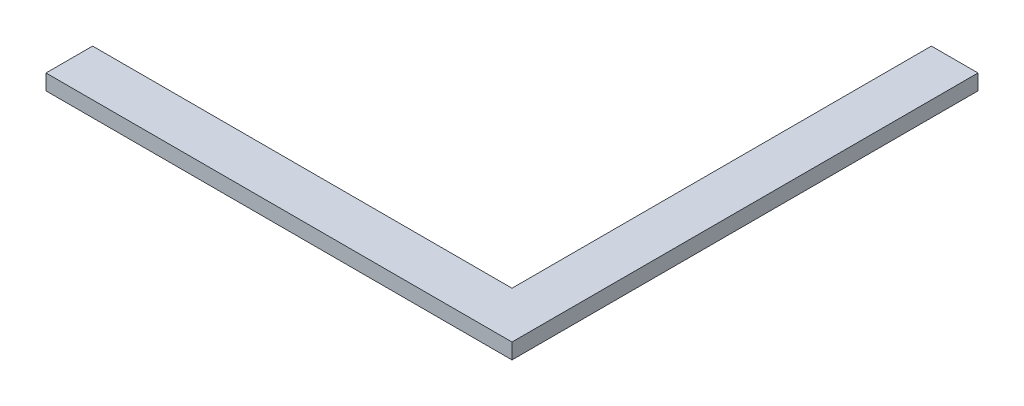
ISO-10303-21;
HEADER;
FILE_DESCRIPTION(('STEP AP214'),'2;1');
FILE_NAME('part.step','',(''),(''),'','','');
FILE_SCHEMA(('AUTOMOTIVE_DESIGN { 1 0 10303 214 1 1 1 1 }'));
ENDSEC;
DATA;
#1=APPLICATION_CONTEXT('core data for automotive mechanical design processes');
#2=APPLICATION_PROTOCOL_DEFINITION('international standard','automotive_design',2000,#1);
#3=PRODUCT_CONTEXT('',#1,'mechanical');
#4=PRODUCT('Part','Part','',(#3));
#5=PRODUCT_RELATED_PRODUCT_CATEGORY('part','',(#4));
#6=PRODUCT_DEFINITION_FORMATION('','',#4);
#7=PRODUCT_DEFINITION_CONTEXT('part definition',#1,'design');
#8=PRODUCT_DEFINITION('design','',#6,#7);
#9=PRODUCT_DEFINITION_SHAPE('','',#8);
#10=(LENGTH_UNIT() NAMED_UNIT(*) SI_UNIT(.MILLI.,.METRE.));
#11=(NAMED_UNIT(*) PLANE_ANGLE_UNIT() SI_UNIT($,.RADIAN.));
#12=(NAMED_UNIT(*) SI_UNIT($,.STERADIAN.) SOLID_ANGLE_UNIT());
#13=UNCERTAINTY_MEASURE_WITH_UNIT(LENGTH_MEASURE(1.E-05),#10,'distance_accuracy_value','');
#14=(GEOMETRIC_REPRESENTATION_CONTEXT(3) GLOBAL_UNCERTAINTY_ASSIGNED_CONTEXT((#13)) GLOBAL_UNIT_ASSIGNED_CONTEXT((#10,
#11,#12)) REPRESENTATION_CONTEXT('',''));
#15=CARTESIAN_POINT('',(0.,0.,0.));
#16=DIRECTION('',(0.,0.,1.));
#17=DIRECTION('',(1.,0.,0.));
#18=AXIS2_PLACEMENT_3D('',#15,#16,#17);
#19=CARTESIAN_POINT('',(150.,10.,150.));
#20=DIRECTION('',(-1.,0.,0.));
#21=DIRECTION('',(0.,0.,1.));
#22=AXIS2_PLACEMENT_3D('',#19,#20,#21);
#23=PLANE('',#22);
#24=DIRECTION('',(0.,0.,-1.));
#25=VECTOR('',#24,1.);
#26=CARTESIAN_POINT('',(150.,0.,150.));
#27=LINE('',#26,#25);
#28=CARTESIAN_POINT('',(150.,0.,150.));
#29=VERTEX_POINT('',#28);
#30=CARTESIAN_POINT('',(150.,0.,-150.));
#31=VERTEX_POINT('',#30);
#32=EDGE_CURVE('E118',#29,#31,#27,.T.);
#33=ORIENTED_EDGE('',*,*,#32,.T.);
#34=DIRECTION('',(0.,-1.,0.));
#35=VECTOR('',#34,1.);
#36=CARTESIAN_POINT('',(150.,10.,-150.));
#37=LINE('',#36,#35);
#38=CARTESIAN_POINT('',(150.,10.,-150.));
#39=VERTEX_POINT('',#38);
#40=EDGE_CURVE('E11',#39,#31,#37,.T.);
#41=ORIENTED_EDGE('',*,*,#40,.F.);
#42=DIRECTION('',(0.,0.,-1.));
#43=VECTOR('',#42,1.);
#44=CARTESIAN_POINT('',(150.,10.,150.));
#45=LINE('',#44,#43);
#46=CARTESIAN_POINT('',(150.,10.,150.));
#47=VERTEX_POINT('',#46);
#48=EDGE_CURVE('E128',#47,#39,#45,.T.);
#49=ORIENTED_EDGE('',*,*,#48,.F.);
#50=DIRECTION('',(0.,-1.,0.));
#51=VECTOR('',#50,1.);
#52=CARTESIAN_POINT('',(150.,10.,150.));
#53=LINE('',#52,#51);
#54=EDGE_CURVE('E114',#47,#29,#53,.T.);
#55=ORIENTED_EDGE('',*,*,#54,.T.);
#56=EDGE_LOOP('',(#33,#41,#49,#55));
#57=FACE_BOUND('',#56,.T.);
#58=ADVANCED_FACE('F34',(#57),#23,.F.);
#59=CARTESIAN_POINT('',(150.,10.,-150.));
#60=DIRECTION('',(0.,0.,1.));
#61=DIRECTION('',(1.,0.,0.));
#62=AXIS2_PLACEMENT_3D('',#59,#60,#61);
#63=PLANE('',#62);
#64=DIRECTION('',(-1.,0.,0.));
#65=VECTOR('',#64,1.);
#66=CARTESIAN_POINT('',(150.,0.,-150.));
#67=LINE('',#66,#65);
#68=CARTESIAN_POINT('',(120.,0.,-150.));
#69=VERTEX_POINT('',#68);
#70=EDGE_CURVE('E121',#31,#69,#67,.T.);
#71=ORIENTED_EDGE('',*,*,#70,.T.);
#72=DIRECTION('',(0.,-1.,0.));
#73=VECTOR('',#72,1.);
#74=CARTESIAN_POINT('',(120.,10.,-150.));
#75=LINE('',#74,#73);
#76=CARTESIAN_POINT('',(120.,10.,-150.));
#77=VERTEX_POINT('',#76);
#78=EDGE_CURVE('E42',#77,#69,#75,.T.);
#79=ORIENTED_EDGE('',*,*,#78,.F.);
#80=DIRECTION('',(-1.,0.,0.));
#81=VECTOR('',#80,1.);
#82=CARTESIAN_POINT('',(150.,10.,-150.));
#83=LINE('',#82,#81);
#84=EDGE_CURVE('E87',#39,#77,#83,.T.);
#85=ORIENTED_EDGE('',*,*,#84,.F.);
#86=ORIENTED_EDGE('',*,*,#40,.T.);
#87=EDGE_LOOP('',(#71,#79,#85,#86));
#88=FACE_BOUND('',#87,.T.);
#89=ADVANCED_FACE('F152',(#88),#63,.F.);
#90=CARTESIAN_POINT('',(120.,10.,-150.));
#91=DIRECTION('',(1.,0.,0.));
#92=DIRECTION('',(0.,0.,-1.));
#93=AXIS2_PLACEMENT_3D('',#90,#91,#92);
#94=PLANE('',#93);
#95=DIRECTION('',(0.,0.,1.));
#96=VECTOR('',#95,1.);
#97=CARTESIAN_POINT('',(120.,0.,-150.));
#98=LINE('',#97,#96);
#99=CARTESIAN_POINT('',(120.,0.,120.));
#100=VERTEX_POINT('',#99);
#101=EDGE_CURVE('E123',#69,#100,#98,.T.);
#102=ORIENTED_EDGE('',*,*,#101,.T.);
#103=DIRECTION('',(0.,-1.,0.));
#104=VECTOR('',#103,1.);
#105=CARTESIAN_POINT('',(120.,10.,120.));
#106=LINE('',#105,#104);
#107=CARTESIAN_POINT('',(120.,10.,120.));
#108=VERTEX_POINT('',#107);
#109=EDGE_CURVE('E109',#108,#100,#106,.T.);
#110=ORIENTED_EDGE('',*,*,#109,.F.);
#111=DIRECTION('',(0.,0.,1.));
#112=VECTOR('',#111,1.);
#113=CARTESIAN_POINT('',(120.,10.,-150.));
#114=LINE('',#113,#112);
#115=EDGE_CURVE('E100',#77,#108,#114,.T.);
#116=ORIENTED_EDGE('',*,*,#115,.F.);
#117=ORIENTED_EDGE('',*,*,#78,.T.);
#118=EDGE_LOOP('',(#102,#110,#116,#117));
#119=FACE_BOUND('',#118,.T.);
#120=ADVANCED_FACE('F134',(#119),#94,.F.);
#121=CARTESIAN_POINT('',(120.,10.,120.));
#122=DIRECTION('',(0.,0.,1.));
#123=DIRECTION('',(1.,0.,0.));
#124=AXIS2_PLACEMENT_3D('',#121,#122,#123);
#125=PLANE('',#124);
#126=DIRECTION('',(-1.,0.,0.));
#127=VECTOR('',#126,1.);
#128=CARTESIAN_POINT('',(120.,0.,120.));
#129=LINE('',#128,#127);
#130=CARTESIAN_POINT('',(-150.,0.,120.));
#131=VERTEX_POINT('',#130);
#132=EDGE_CURVE('E108',#100,#131,#129,.T.);
#133=ORIENTED_EDGE('',*,*,#132,.T.);
#134=DIRECTION('',(0.,-1.,0.));
#135=VECTOR('',#134,1.);
#136=CARTESIAN_POINT('',(-150.,10.,120.));
#137=LINE('',#136,#135);
#138=CARTESIAN_POINT('',(-150.,10.,120.));
#139=VERTEX_POINT('',#138);
#140=EDGE_CURVE('E105',#139,#131,#137,.T.);
#141=ORIENTED_EDGE('',*,*,#140,.F.);
#142=DIRECTION('',(-1.,0.,0.));
#143=VECTOR('',#142,1.);
#144=CARTESIAN_POINT('',(120.,10.,120.));
#145=LINE('',#144,#143);
#146=EDGE_CURVE('E94',#108,#139,#145,.T.);
#147=ORIENTED_EDGE('',*,*,#146,.F.);
#148=ORIENTED_EDGE('',*,*,#109,.T.);
#149=EDGE_LOOP('',(#133,#141,#147,#148));
#150=FACE_BOUND('',#149,.T.);
#151=ADVANCED_FACE('F106',(#150),#125,.F.);
#152=CARTESIAN_POINT('',(-150.,10.,120.));
#153=DIRECTION('',(1.,0.,0.));
#154=DIRECTION('',(0.,0.,-1.));
#155=AXIS2_PLACEMENT_3D('',#152,#153,#154);
#156=PLANE('',#155);
#157=DIRECTION('',(0.,0.,1.));
#158=VECTOR('',#157,1.);
#159=CARTESIAN_POINT('',(-150.,0.,120.));
#160=LINE('',#159,#158);
#161=CARTESIAN_POINT('',(-150.,0.,150.));
#162=VERTEX_POINT('',#161);
#163=EDGE_CURVE('E73',#131,#162,#160,.T.);
#164=ORIENTED_EDGE('',*,*,#163,.T.);
#165=DIRECTION('',(0.,-1.,0.));
#166=VECTOR('',#165,1.);
#167=CARTESIAN_POINT('',(-150.,10.,150.));
#168=LINE('',#167,#166);
#169=CARTESIAN_POINT('',(-150.,10.,150.));
#170=VERTEX_POINT('',#169);
#171=EDGE_CURVE('E110',#170,#162,#168,.T.);
#172=ORIENTED_EDGE('',*,*,#171,.F.);
#173=DIRECTION('',(0.,0.,1.));
#174=VECTOR('',#173,1.);
#175=CARTESIAN_POINT('',(-150.,10.,120.));
#176=LINE('',#175,#174);
#177=EDGE_CURVE('E98',#139,#170,#176,.T.);
#178=ORIENTED_EDGE('',*,*,#177,.F.);
#179=ORIENTED_EDGE('',*,*,#140,.T.);
#180=EDGE_LOOP('',(#164,#172,#178,#179));
#181=FACE_BOUND('',#180,.T.);
#182=ADVANCED_FACE('F112',(#181),#156,.F.);
#183=CARTESIAN_POINT('',(-150.,10.,150.));
#184=DIRECTION('',(0.,0.,-1.));
#185=DIRECTION('',(-1.,0.,0.));
#186=AXIS2_PLACEMENT_3D('',#183,#184,#185);
#187=PLANE('',#186);
#188=DIRECTION('',(1.,0.,0.));
#189=VECTOR('',#188,1.);
#190=CARTESIAN_POINT('',(-150.,0.,150.));
#191=LINE('',#190,#189);
#192=EDGE_CURVE('E79',#162,#29,#191,.T.);
#193=ORIENTED_EDGE('',*,*,#192,.T.);
#194=ORIENTED_EDGE('',*,*,#54,.F.);
#195=DIRECTION('',(1.,0.,0.));
#196=VECTOR('',#195,1.);
#197=CARTESIAN_POINT('',(-150.,10.,150.));
#198=LINE('',#197,#196);
#199=EDGE_CURVE('E50',#170,#47,#198,.T.);
#200=ORIENTED_EDGE('',*,*,#199,.F.);
#201=ORIENTED_EDGE('',*,*,#171,.T.);
#202=EDGE_LOOP('',(#193,#194,#200,#201));
#203=FACE_BOUND('',#202,.T.);
#204=ADVANCED_FACE('F141',(#203),#187,.F.);
#205=CARTESIAN_POINT('',(0.,10.,0.));
#206=DIRECTION('',(0.,1.,0.));
#207=DIRECTION('',(0.,0.,1.));
#208=AXIS2_PLACEMENT_3D('',#205,#206,#207);
#209=PLANE('',#208);
#210=ORIENTED_EDGE('',*,*,#48,.T.);
#211=ORIENTED_EDGE('',*,*,#84,.T.);
#212=ORIENTED_EDGE('',*,*,#115,.T.);
#213=ORIENTED_EDGE('',*,*,#146,.T.);
#214=ORIENTED_EDGE('',*,*,#177,.T.);
#215=ORIENTED_EDGE('',*,*,#199,.T.);
#216=EDGE_LOOP('',(#210,#211,#212,#213,#214,#215));
#217=FACE_BOUND('',#216,.T.);
#218=ADVANCED_FACE('F96',(#217),#209,.T.);
#219=CARTESIAN_POINT('',(0.,0.,0.));
#220=DIRECTION('',(0.,1.,0.));
#221=DIRECTION('',(0.,0.,1.));
#222=AXIS2_PLACEMENT_3D('',#219,#220,#221);
#223=PLANE('',#222);
#224=ORIENTED_EDGE('',*,*,#32,.F.);
#225=ORIENTED_EDGE('',*,*,#192,.F.);
#226=ORIENTED_EDGE('',*,*,#163,.F.);
#227=ORIENTED_EDGE('',*,*,#132,.F.);
#228=ORIENTED_EDGE('',*,*,#101,.F.);
#229=ORIENTED_EDGE('',*,*,#70,.F.);
#230=EDGE_LOOP('',(#224,#225,#226,#227,#228,#229));
#231=FACE_BOUND('',#230,.T.);
#232=ADVANCED_FACE('F137',(#231),#223,.F.);
#233=CLOSED_SHELL('',(#58,#89,#120,#151,#182,#204,#218,#232));
#234=MANIFOLD_SOLID_BREP('B2',#233);
#235=ADVANCED_BREP_SHAPE_REPRESENTATION('',(#18,#234),#14);
#236=SHAPE_DEFINITION_REPRESENTATION(#9,#235);
ENDSEC;
END-ISO-10303-21;
